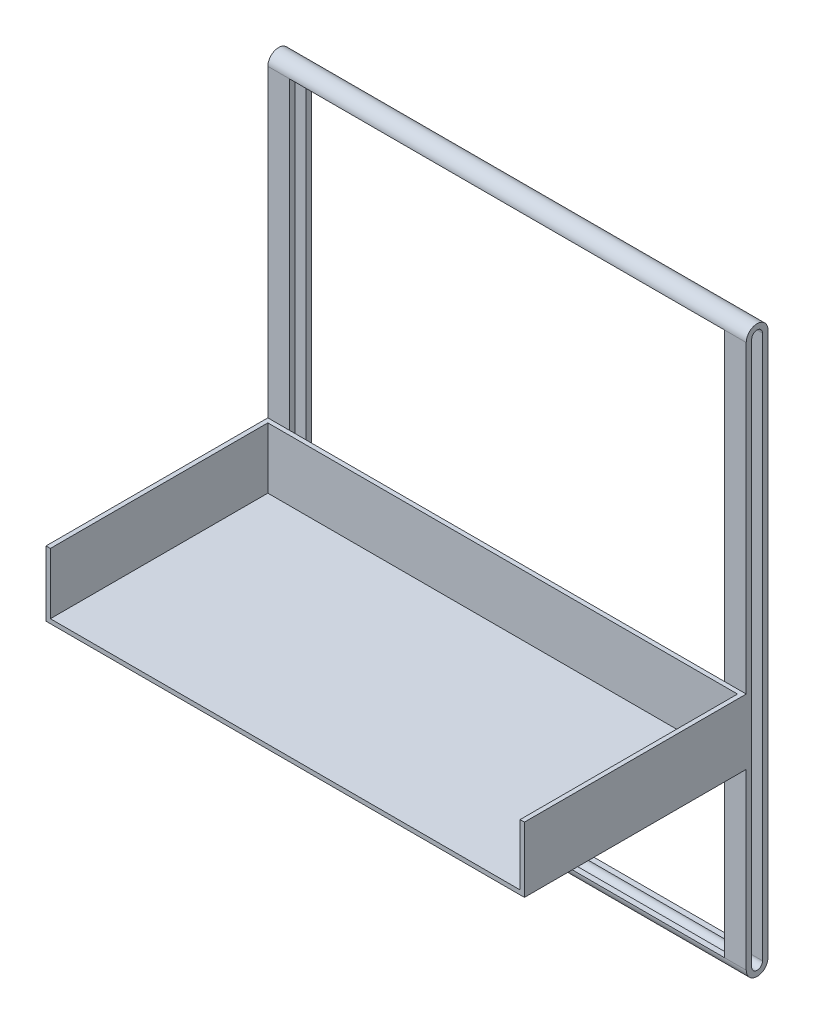
ISO-10303-21;
HEADER;
FILE_DESCRIPTION(('STEP AP214'),'2;1');
FILE_NAME('part.step','',(''),(''),'','','');
FILE_SCHEMA(('AUTOMOTIVE_DESIGN { 1 0 10303 214 1 1 1 1 }'));
ENDSEC;
DATA;
#1=APPLICATION_CONTEXT('core data for automotive mechanical design processes');
#2=APPLICATION_PROTOCOL_DEFINITION('international standard','automotive_design',2000,#1);
#3=PRODUCT_CONTEXT('',#1,'mechanical');
#4=PRODUCT('Part','Part','',(#3));
#5=PRODUCT_RELATED_PRODUCT_CATEGORY('part','',(#4));
#6=PRODUCT_DEFINITION_FORMATION('','',#4);
#7=PRODUCT_DEFINITION_CONTEXT('part definition',#1,'design');
#8=PRODUCT_DEFINITION('design','',#6,#7);
#9=PRODUCT_DEFINITION_SHAPE('','',#8);
#10=(LENGTH_UNIT() NAMED_UNIT(*) SI_UNIT(.MILLI.,.METRE.));
#11=(NAMED_UNIT(*) PLANE_ANGLE_UNIT() SI_UNIT($,.RADIAN.));
#12=(NAMED_UNIT(*) SI_UNIT($,.STERADIAN.) SOLID_ANGLE_UNIT());
#13=UNCERTAINTY_MEASURE_WITH_UNIT(LENGTH_MEASURE(1.E-05),#10,'distance_accuracy_value','');
#14=(GEOMETRIC_REPRESENTATION_CONTEXT(3) GLOBAL_UNCERTAINTY_ASSIGNED_CONTEXT((#13)) GLOBAL_UNIT_ASSIGNED_CONTEXT((#10,
#11,#12)) REPRESENTATION_CONTEXT('',''));
#15=CARTESIAN_POINT('',(0.,0.,0.));
#16=DIRECTION('',(0.,0.,1.));
#17=DIRECTION('',(1.,0.,0.));
#18=AXIS2_PLACEMENT_3D('',#15,#16,#17);
#19=CARTESIAN_POINT('',(0.,0.,2.));
#20=DIRECTION('',(0.,0.,1.));
#21=DIRECTION('',(1.,0.,0.));
#22=AXIS2_PLACEMENT_3D('',#19,#20,#21);
#23=PLANE('',#22);
#24=DIRECTION('',(-1.,0.,0.));
#25=VECTOR('',#24,1.);
#26=CARTESIAN_POINT('',(0.,-168.,2.));
#27=LINE('',#26,#25);
#28=CARTESIAN_POINT('',(218.,-168.,2.));
#29=VERTEX_POINT('',#28);
#30=CARTESIAN_POINT('',(2.,-168.,2.));
#31=VERTEX_POINT('',#30);
#32=EDGE_CURVE('E37',#29,#31,#27,.T.);
#33=ORIENTED_EDGE('',*,*,#32,.F.);
#34=DIRECTION('',(0.,-1.,0.));
#35=VECTOR('',#34,1.);
#36=CARTESIAN_POINT('',(218.,-168.,2.));
#37=LINE('',#36,#35);
#38=CARTESIAN_POINT('',(218.,-140.,2.));
#39=VERTEX_POINT('',#38);
#40=EDGE_CURVE('E237',#39,#29,#37,.T.);
#41=ORIENTED_EDGE('',*,*,#40,.F.);
#42=DIRECTION('',(-1.,0.,0.));
#43=VECTOR('',#42,1.);
#44=CARTESIAN_POINT('',(0.,-140.,2.));
#45=LINE('',#44,#43);
#46=CARTESIAN_POINT('',(2.,-140.,2.));
#47=VERTEX_POINT('',#46);
#48=EDGE_CURVE('E264',#39,#47,#45,.T.);
#49=ORIENTED_EDGE('',*,*,#48,.T.);
#50=DIRECTION('',(0.,1.,0.));
#51=VECTOR('',#50,1.);
#52=CARTESIAN_POINT('',(2.,-168.,2.));
#53=LINE('',#52,#51);
#54=EDGE_CURVE('E244',#31,#47,#53,.T.);
#55=ORIENTED_EDGE('',*,*,#54,.F.);
#56=EDGE_LOOP('',(#33,#41,#49,#55));
#57=FACE_BOUND('',#56,.T.);
#58=ADVANCED_FACE('F33',(#57),#23,.T.);
#59=CARTESIAN_POINT('',(0.,-168.,102.));
#60=DIRECTION('',(0.,-1.,0.));
#61=DIRECTION('',(0.,0.,-1.));
#62=AXIS2_PLACEMENT_3D('',#59,#60,#61);
#63=PLANE('',#62);
#64=DIRECTION('',(0.,0.,-1.));
#65=VECTOR('',#64,1.);
#66=CARTESIAN_POINT('',(218.,-168.,102.));
#67=LINE('',#66,#65);
#68=CARTESIAN_POINT('',(218.,-168.,102.));
#69=VERTEX_POINT('',#68);
#70=EDGE_CURVE('E50',#69,#29,#67,.T.);
#71=ORIENTED_EDGE('',*,*,#70,.T.);
#72=ORIENTED_EDGE('',*,*,#32,.T.);
#73=DIRECTION('',(0.,0.,-1.));
#74=VECTOR('',#73,1.);
#75=CARTESIAN_POINT('',(2.,-168.,102.));
#76=LINE('',#75,#74);
#77=CARTESIAN_POINT('',(2.,-168.,102.));
#78=VERTEX_POINT('',#77);
#79=EDGE_CURVE('E255',#78,#31,#76,.T.);
#80=ORIENTED_EDGE('',*,*,#79,.F.);
#81=DIRECTION('',(-1.,0.,0.));
#82=VECTOR('',#81,1.);
#83=CARTESIAN_POINT('',(0.,-168.,102.));
#84=LINE('',#83,#82);
#85=EDGE_CURVE('E231',#69,#78,#84,.T.);
#86=ORIENTED_EDGE('',*,*,#85,.F.);
#87=EDGE_LOOP('',(#71,#72,#80,#86));
#88=FACE_BOUND('',#87,.T.);
#89=ADVANCED_FACE('F518',(#88),#63,.F.);
#90=CARTESIAN_POINT('',(220.,0.,0.));
#91=DIRECTION('',(0.,0.,-1.));
#92=DIRECTION('',(0.,1.,0.));
#93=AXIS2_PLACEMENT_3D('',#90,#91,#92);
#94=PLANE('',#93);
#95=DIRECTION('',(1.,0.,0.));
#96=VECTOR('',#95,1.);
#97=CARTESIAN_POINT('',(0.,-170.,0.));
#98=LINE('',#97,#96);
#99=CARTESIAN_POINT('',(0.,-170.,0.));
#100=VERTEX_POINT('',#99);
#101=CARTESIAN_POINT('',(10.,-170.,0.));
#102=VERTEX_POINT('',#101);
#103=EDGE_CURVE('E58',#100,#102,#98,.T.);
#104=ORIENTED_EDGE('',*,*,#103,.F.);
#105=DIRECTION('',(0.,-1.,0.));
#106=VECTOR('',#105,1.);
#107=CARTESIAN_POINT('',(0.,0.,0.));
#108=LINE('',#107,#106);
#109=CARTESIAN_POINT('',(0.,-250.,0.));
#110=VERTEX_POINT('',#109);
#111=EDGE_CURVE('E387',#100,#110,#108,.T.);
#112=ORIENTED_EDGE('',*,*,#111,.T.);
#113=DIRECTION('',(-1.,0.,0.));
#114=VECTOR('',#113,1.);
#115=CARTESIAN_POINT('',(220.,-250.,0.));
#116=LINE('',#115,#114);
#117=CARTESIAN_POINT('',(10.,-250.,0.));
#118=VERTEX_POINT('',#117);
#119=EDGE_CURVE('E403',#118,#110,#116,.T.);
#120=ORIENTED_EDGE('',*,*,#119,.F.);
#121=DIRECTION('',(0.,-1.,0.));
#122=VECTOR('',#121,1.);
#123=CARTESIAN_POINT('',(10.,0.,0.));
#124=LINE('',#123,#122);
#125=EDGE_CURVE('E279',#102,#118,#124,.T.);
#126=ORIENTED_EDGE('',*,*,#125,.F.);
#127=EDGE_LOOP('',(#104,#112,#120,#126));
#128=FACE_BOUND('',#127,.T.);
#129=ADVANCED_FACE('F500',(#128),#94,.F.);
#130=DIRECTION('',(-1.,0.,0.));
#131=VECTOR('',#130,1.);
#132=CARTESIAN_POINT('',(0.,-140.,0.));
#133=LINE('',#132,#131);
#134=CARTESIAN_POINT('',(10.,-140.,0.));
#135=VERTEX_POINT('',#134);
#136=CARTESIAN_POINT('',(0.,-140.,0.));
#137=VERTEX_POINT('',#136);
#138=EDGE_CURVE('E268',#135,#137,#133,.T.);
#139=ORIENTED_EDGE('',*,*,#138,.F.);
#140=CARTESIAN_POINT('',(10.,0.,0.));
#141=VERTEX_POINT('',#140);
#142=EDGE_CURVE('E280',#141,#135,#124,.T.);
#143=ORIENTED_EDGE('',*,*,#142,.F.);
#144=DIRECTION('',(-1.,0.,0.));
#145=VECTOR('',#144,1.);
#146=CARTESIAN_POINT('',(220.,0.,0.));
#147=LINE('',#146,#145);
#148=CARTESIAN_POINT('',(0.,0.,0.));
#149=VERTEX_POINT('',#148);
#150=EDGE_CURVE('E407',#141,#149,#147,.T.);
#151=ORIENTED_EDGE('',*,*,#150,.T.);
#152=EDGE_CURVE('E388',#149,#137,#108,.T.);
#153=ORIENTED_EDGE('',*,*,#152,.T.);
#154=EDGE_LOOP('',(#139,#143,#151,#153));
#155=FACE_BOUND('',#154,.T.);
#156=ADVANCED_FACE('F462',(#155),#94,.F.);
#157=CARTESIAN_POINT('',(210.,-170.,0.));
#158=VERTEX_POINT('',#157);
#159=CARTESIAN_POINT('',(220.,-170.,0.));
#160=VERTEX_POINT('',#159);
#161=EDGE_CURVE('E261',#158,#160,#98,.T.);
#162=ORIENTED_EDGE('',*,*,#161,.F.);
#163=DIRECTION('',(0.,1.,0.));
#164=VECTOR('',#163,1.);
#165=CARTESIAN_POINT('',(210.,0.,0.));
#166=LINE('',#165,#164);
#167=CARTESIAN_POINT('',(210.,-250.,0.));
#168=VERTEX_POINT('',#167);
#169=EDGE_CURVE('E287',#168,#158,#166,.T.);
#170=ORIENTED_EDGE('',*,*,#169,.F.);
#171=CARTESIAN_POINT('',(220.,-250.,0.));
#172=VERTEX_POINT('',#171);
#173=EDGE_CURVE('E404',#172,#168,#116,.T.);
#174=ORIENTED_EDGE('',*,*,#173,.F.);
#175=DIRECTION('',(0.,-1.,0.));
#176=VECTOR('',#175,1.);
#177=CARTESIAN_POINT('',(220.,0.,0.));
#178=LINE('',#177,#176);
#179=EDGE_CURVE('E377',#160,#172,#178,.T.);
#180=ORIENTED_EDGE('',*,*,#179,.F.);
#181=EDGE_LOOP('',(#162,#170,#174,#180));
#182=FACE_BOUND('',#181,.T.);
#183=ADVANCED_FACE('F486',(#182),#94,.F.);
#184=CARTESIAN_POINT('',(220.,-140.,0.));
#185=VERTEX_POINT('',#184);
#186=CARTESIAN_POINT('',(210.,-140.,0.));
#187=VERTEX_POINT('',#186);
#188=EDGE_CURVE('E266',#185,#187,#133,.T.);
#189=ORIENTED_EDGE('',*,*,#188,.F.);
#190=CARTESIAN_POINT('',(220.,0.,0.));
#191=VERTEX_POINT('',#190);
#192=EDGE_CURVE('E216',#191,#185,#178,.T.);
#193=ORIENTED_EDGE('',*,*,#192,.F.);
#194=CARTESIAN_POINT('',(210.,0.,0.));
#195=VERTEX_POINT('',#194);
#196=EDGE_CURVE('E408',#191,#195,#147,.T.);
#197=ORIENTED_EDGE('',*,*,#196,.T.);
#198=EDGE_CURVE('E286',#187,#195,#166,.T.);
#199=ORIENTED_EDGE('',*,*,#198,.F.);
#200=EDGE_LOOP('',(#189,#193,#197,#199));
#201=FACE_BOUND('',#200,.T.);
#202=ADVANCED_FACE('F478',(#201),#94,.F.);
#203=CARTESIAN_POINT('',(220.,0.,-10.));
#204=DIRECTION('',(0.,0.,1.));
#205=DIRECTION('',(0.,-1.,0.));
#206=AXIS2_PLACEMENT_3D('',#203,#204,#205);
#207=PLANE('',#206);
#208=DIRECTION('',(-1.,0.,0.));
#209=VECTOR('',#208,1.);
#210=CARTESIAN_POINT('',(220.,0.,-10.));
#211=LINE('',#210,#209);
#212=CARTESIAN_POINT('',(10.,0.,-10.));
#213=VERTEX_POINT('',#212);
#214=CARTESIAN_POINT('',(0.,0.,-10.));
#215=VERTEX_POINT('',#214);
#216=EDGE_CURVE('E384',#213,#215,#211,.T.);
#217=ORIENTED_EDGE('',*,*,#216,.F.);
#218=DIRECTION('',(0.,-1.,0.));
#219=VECTOR('',#218,1.);
#220=CARTESIAN_POINT('',(10.,0.,-10.));
#221=LINE('',#220,#219);
#222=CARTESIAN_POINT('',(10.,-250.,-10.));
#223=VERTEX_POINT('',#222);
#224=EDGE_CURVE('E329',#213,#223,#221,.T.);
#225=ORIENTED_EDGE('',*,*,#224,.T.);
#226=DIRECTION('',(-1.,0.,0.));
#227=VECTOR('',#226,1.);
#228=CARTESIAN_POINT('',(220.,-250.,-10.));
#229=LINE('',#228,#227);
#230=CARTESIAN_POINT('',(0.,-250.,-10.));
#231=VERTEX_POINT('',#230);
#232=EDGE_CURVE('E399',#223,#231,#229,.T.);
#233=ORIENTED_EDGE('',*,*,#232,.T.);
#234=DIRECTION('',(0.,1.,0.));
#235=VECTOR('',#234,1.);
#236=CARTESIAN_POINT('',(0.,0.,-10.));
#237=LINE('',#236,#235);
#238=EDGE_CURVE('E378',#231,#215,#237,.T.);
#239=ORIENTED_EDGE('',*,*,#238,.T.);
#240=EDGE_LOOP('',(#217,#225,#233,#239));
#241=FACE_BOUND('',#240,.T.);
#242=ADVANCED_FACE('F516',(#241),#207,.F.);
#243=CARTESIAN_POINT('',(220.001,0.,-2.5));
#244=DIRECTION('',(0.,0.,1.));
#245=DIRECTION('',(0.,-1.,0.));
#246=AXIS2_PLACEMENT_3D('',#243,#244,#245);
#247=PLANE('',#246);
#248=DIRECTION('',(-1.,0.,0.));
#249=VECTOR('',#248,1.);
#250=CARTESIAN_POINT('',(220.001,0.,-2.5));
#251=LINE('',#250,#249);
#252=CARTESIAN_POINT('',(10.,0.,-2.5));
#253=VERTEX_POINT('',#252);
#254=CARTESIAN_POINT('',(0.,0.,-2.5));
#255=VERTEX_POINT('',#254);
#256=EDGE_CURVE('E358',#253,#255,#251,.T.);
#257=ORIENTED_EDGE('',*,*,#256,.F.);
#258=DIRECTION('',(0.,-1.,0.));
#259=VECTOR('',#258,1.);
#260=CARTESIAN_POINT('',(10.,0.,-2.5));
#261=LINE('',#260,#259);
#262=CARTESIAN_POINT('',(10.,-250.,-2.5));
#263=VERTEX_POINT('',#262);
#264=EDGE_CURVE('E326',#253,#263,#261,.T.);
#265=ORIENTED_EDGE('',*,*,#264,.T.);
#266=DIRECTION('',(-1.,0.,0.));
#267=VECTOR('',#266,1.);
#268=CARTESIAN_POINT('',(220.001,-250.,-2.5));
#269=LINE('',#268,#267);
#270=CARTESIAN_POINT('',(0.,-250.,-2.5));
#271=VERTEX_POINT('',#270);
#272=EDGE_CURVE('E362',#263,#271,#269,.T.);
#273=ORIENTED_EDGE('',*,*,#272,.T.);
#274=DIRECTION('',(0.,1.,0.));
#275=VECTOR('',#274,1.);
#276=CARTESIAN_POINT('',(0.,0.,-2.5));
#277=LINE('',#276,#275);
#278=EDGE_CURVE('E350',#271,#255,#277,.T.);
#279=ORIENTED_EDGE('',*,*,#278,.T.);
#280=EDGE_LOOP('',(#257,#265,#273,#279));
#281=FACE_BOUND('',#280,.T.);
#282=ADVANCED_FACE('F447',(#281),#247,.F.);
#283=CARTESIAN_POINT('',(220.001,0.,-7.5));
#284=DIRECTION('',(0.,0.,-1.));
#285=DIRECTION('',(0.,1.,0.));
#286=AXIS2_PLACEMENT_3D('',#283,#284,#285);
#287=PLANE('',#286);
#288=DIRECTION('',(-1.,0.,0.));
#289=VECTOR('',#288,1.);
#290=CARTESIAN_POINT('',(220.001,-250.,-7.49999999999997));
#291=LINE('',#290,#289);
#292=CARTESIAN_POINT('',(10.,-250.,-7.49999999999997));
#293=VERTEX_POINT('',#292);
#294=CARTESIAN_POINT('',(0.,-250.,-7.49999999999997));
#295=VERTEX_POINT('',#294);
#296=EDGE_CURVE('E367',#293,#295,#291,.T.);
#297=ORIENTED_EDGE('',*,*,#296,.F.);
#298=DIRECTION('',(0.,1.,0.));
#299=VECTOR('',#298,1.);
#300=CARTESIAN_POINT('',(10.,0.,-7.5));
#301=LINE('',#300,#299);
#302=CARTESIAN_POINT('',(10.,0.,-7.50000000000001));
#303=VERTEX_POINT('',#302);
#304=EDGE_CURVE('E11',#293,#303,#301,.T.);
#305=ORIENTED_EDGE('',*,*,#304,.T.);
#306=DIRECTION('',(-1.,0.,0.));
#307=VECTOR('',#306,1.);
#308=CARTESIAN_POINT('',(220.001,0.,-7.5));
#309=LINE('',#308,#307);
#310=CARTESIAN_POINT('',(0.,0.,-7.5));
#311=VERTEX_POINT('',#310);
#312=EDGE_CURVE('E353',#303,#311,#309,.T.);
#313=ORIENTED_EDGE('',*,*,#312,.T.);
#314=DIRECTION('',(0.,-1.,0.));
#315=VECTOR('',#314,1.);
#316=CARTESIAN_POINT('',(0.,0.,-7.5));
#317=LINE('',#316,#315);
#318=EDGE_CURVE('E344',#311,#295,#317,.T.);
#319=ORIENTED_EDGE('',*,*,#318,.T.);
#320=EDGE_LOOP('',(#297,#305,#313,#319));
#321=FACE_BOUND('',#320,.T.);
#322=ADVANCED_FACE('F435',(#321),#287,.F.);
#323=CARTESIAN_POINT('',(220.,0.,-5.));
#324=DIRECTION('',(-1.,0.,0.));
#325=DIRECTION('',(0.,0.,1.));
#326=AXIS2_PLACEMENT_3D('',#323,#324,#325);
#327=CYLINDRICAL_SURFACE('',#326,5.);
#328=CARTESIAN_POINT('',(0.,0.,-5.));
#329=DIRECTION('',(1.,0.,0.));
#330=DIRECTION('',(0.,0.,-1.));
#331=AXIS2_PLACEMENT_3D('',#328,#329,#330);
#332=CIRCLE('',#331,5.);
#333=EDGE_CURVE('E374',#215,#149,#332,.T.);
#334=ORIENTED_EDGE('',*,*,#333,.T.);
#335=ORIENTED_EDGE('',*,*,#150,.F.);
#336=DIRECTION('',(-1.,0.,0.));
#337=VECTOR('',#336,1.);
#338=CARTESIAN_POINT('',(10.,0.,0.));
#339=LINE('',#338,#337);
#340=EDGE_CURVE('E290',#195,#141,#339,.T.);
#341=ORIENTED_EDGE('',*,*,#340,.F.);
#342=ORIENTED_EDGE('',*,*,#196,.F.);
#343=CARTESIAN_POINT('',(220.,0.,-5.));
#344=DIRECTION('',(1.,0.,0.));
#345=DIRECTION('',(0.,0.,-1.));
#346=AXIS2_PLACEMENT_3D('',#343,#344,#345);
#347=CIRCLE('',#346,5.);
#348=CARTESIAN_POINT('',(220.,0.,-10.));
#349=VERTEX_POINT('',#348);
#350=EDGE_CURVE('E375',#349,#191,#347,.T.);
#351=ORIENTED_EDGE('',*,*,#350,.F.);
#352=CARTESIAN_POINT('',(210.,0.,-10.));
#353=VERTEX_POINT('',#352);
#354=EDGE_CURVE('E396',#349,#353,#211,.T.);
#355=ORIENTED_EDGE('',*,*,#354,.T.);
#356=DIRECTION('',(-1.,0.,0.));
#357=VECTOR('',#356,1.);
#358=CARTESIAN_POINT('',(220.,0.,-10.));
#359=LINE('',#358,#357);
#360=EDGE_CURVE('E323',#353,#213,#359,.T.);
#361=ORIENTED_EDGE('',*,*,#360,.T.);
#362=ORIENTED_EDGE('',*,*,#216,.T.);
#363=EDGE_LOOP('',(#334,#335,#341,#342,#351,#355,#361,#362));
#364=FACE_BOUND('',#363,.T.);
#365=ADVANCED_FACE('F35',(#364),#327,.T.);
#366=CARTESIAN_POINT('',(220.,-250.,-5.00000000000003));
#367=DIRECTION('',(-1.,0.,0.));
#368=DIRECTION('',(0.,0.,1.));
#369=AXIS2_PLACEMENT_3D('',#366,#367,#368);
#370=CYLINDRICAL_SURFACE('',#369,5.);
#371=CARTESIAN_POINT('',(0.,-250.,-5.00000000000003));
#372=DIRECTION('',(1.,0.,0.));
#373=DIRECTION('',(0.,0.,1.));
#374=AXIS2_PLACEMENT_3D('',#371,#372,#373);
#375=CIRCLE('',#374,5.);
#376=EDGE_CURVE('E391',#110,#231,#375,.T.);
#377=ORIENTED_EDGE('',*,*,#376,.T.);
#378=ORIENTED_EDGE('',*,*,#232,.F.);
#379=DIRECTION('',(1.,0.,0.));
#380=VECTOR('',#379,1.);
#381=CARTESIAN_POINT('',(220.,-250.,-10.));
#382=LINE('',#381,#380);
#383=CARTESIAN_POINT('',(210.,-250.,-10.));
#384=VERTEX_POINT('',#383);
#385=EDGE_CURVE('E311',#223,#384,#382,.T.);
#386=ORIENTED_EDGE('',*,*,#385,.T.);
#387=CARTESIAN_POINT('',(220.,-250.,-10.));
#388=VERTEX_POINT('',#387);
#389=EDGE_CURVE('E400',#388,#384,#229,.T.);
#390=ORIENTED_EDGE('',*,*,#389,.F.);
#391=CARTESIAN_POINT('',(220.,-250.,-5.00000000000003));
#392=DIRECTION('',(1.,0.,0.));
#393=DIRECTION('',(0.,0.,1.));
#394=AXIS2_PLACEMENT_3D('',#391,#392,#393);
#395=CIRCLE('',#394,5.);
#396=EDGE_CURVE('E380',#172,#388,#395,.T.);
#397=ORIENTED_EDGE('',*,*,#396,.F.);
#398=ORIENTED_EDGE('',*,*,#173,.T.);
#399=DIRECTION('',(1.,0.,0.));
#400=VECTOR('',#399,1.);
#401=CARTESIAN_POINT('',(10.,-250.,0.));
#402=LINE('',#401,#400);
#403=EDGE_CURVE('E283',#118,#168,#402,.T.);
#404=ORIENTED_EDGE('',*,*,#403,.F.);
#405=ORIENTED_EDGE('',*,*,#119,.T.);
#406=EDGE_LOOP('',(#377,#378,#386,#390,#397,#398,#404,#405));
#407=FACE_BOUND('',#406,.T.);
#408=ADVANCED_FACE('F491',(#407),#370,.T.);
#409=ORIENTED_EDGE('',*,*,#389,.T.);
#410=DIRECTION('',(0.,1.,0.));
#411=VECTOR('',#410,1.);
#412=CARTESIAN_POINT('',(210.,0.,-10.));
#413=LINE('',#412,#411);
#414=EDGE_CURVE('E317',#384,#353,#413,.T.);
#415=ORIENTED_EDGE('',*,*,#414,.T.);
#416=ORIENTED_EDGE('',*,*,#354,.F.);
#417=DIRECTION('',(0.,1.,0.));
#418=VECTOR('',#417,1.);
#419=CARTESIAN_POINT('',(220.,0.,-10.));
#420=LINE('',#419,#418);
#421=EDGE_CURVE('E382',#388,#349,#420,.T.);
#422=ORIENTED_EDGE('',*,*,#421,.F.);
#423=EDGE_LOOP('',(#409,#415,#416,#422));
#424=FACE_BOUND('',#423,.T.);
#425=ADVANCED_FACE('F557',(#424),#207,.F.);
#426=CARTESIAN_POINT('',(220.,0.,-5.));
#427=DIRECTION('',(1.,0.,0.));
#428=DIRECTION('',(0.,0.,-1.));
#429=AXIS2_PLACEMENT_3D('',#426,#427,#428);
#430=PLANE('',#429);
#431=CARTESIAN_POINT('',(220.,0.,-5.));
#432=DIRECTION('',(1.,0.,0.));
#433=DIRECTION('',(0.,0.,-1.));
#434=AXIS2_PLACEMENT_3D('',#431,#432,#433);
#435=CIRCLE('',#434,2.5);
#436=CARTESIAN_POINT('',(220.,0.,-2.5));
#437=VERTEX_POINT('',#436);
#438=CARTESIAN_POINT('',(220.,0.,-7.5));
#439=VERTEX_POINT('',#438);
#440=EDGE_CURVE('E338',#437,#439,#435,.F.);
#441=ORIENTED_EDGE('',*,*,#440,.T.);
#442=DIRECTION('',(0.,-1.,0.));
#443=VECTOR('',#442,1.);
#444=CARTESIAN_POINT('',(220.,0.,-7.5));
#445=LINE('',#444,#443);
#446=CARTESIAN_POINT('',(220.,-250.,-7.49999999999997));
#447=VERTEX_POINT('',#446);
#448=EDGE_CURVE('E357',#439,#447,#445,.T.);
#449=ORIENTED_EDGE('',*,*,#448,.T.);
#450=CARTESIAN_POINT('',(220.,-250.,-5.));
#451=DIRECTION('',(1.,0.,0.));
#452=DIRECTION('',(0.,0.,-1.));
#453=AXIS2_PLACEMENT_3D('',#450,#451,#452);
#454=CIRCLE('',#453,2.5);
#455=CARTESIAN_POINT('',(220.,-250.,-2.5));
#456=VERTEX_POINT('',#455);
#457=EDGE_CURVE('E332',#447,#456,#454,.F.);
#458=ORIENTED_EDGE('',*,*,#457,.T.);
#459=DIRECTION('',(0.,1.,0.));
#460=VECTOR('',#459,1.);
#461=CARTESIAN_POINT('',(220.,0.,-2.5));
#462=LINE('',#461,#460);
#463=EDGE_CURVE('E335',#456,#437,#462,.T.);
#464=ORIENTED_EDGE('',*,*,#463,.T.);
#465=EDGE_LOOP('',(#441,#449,#458,#464));
#466=FACE_BOUND('',#465,.T.);
#467=ORIENTED_EDGE('',*,*,#350,.T.);
#468=ORIENTED_EDGE('',*,*,#192,.T.);
#469=DIRECTION('',(0.,0.,-1.));
#470=VECTOR('',#469,1.);
#471=CARTESIAN_POINT('',(220.,-140.,2.));
#472=LINE('',#471,#470);
#473=CARTESIAN_POINT('',(220.,-140.,102.));
#474=VERTEX_POINT('',#473);
#475=EDGE_CURVE('E210',#474,#185,#472,.T.);
#476=ORIENTED_EDGE('',*,*,#475,.F.);
#477=DIRECTION('',(0.,1.,0.));
#478=VECTOR('',#477,1.);
#479=CARTESIAN_POINT('',(220.,-170.,102.));
#480=LINE('',#479,#478);
#481=CARTESIAN_POINT('',(220.,-170.,102.));
#482=VERTEX_POINT('',#481);
#483=EDGE_CURVE('E215',#482,#474,#480,.T.);
#484=ORIENTED_EDGE('',*,*,#483,.F.);
#485=DIRECTION('',(0.,0.,-1.));
#486=VECTOR('',#485,1.);
#487=CARTESIAN_POINT('',(220.,-170.,2.));
#488=LINE('',#487,#486);
#489=EDGE_CURVE('E220',#482,#160,#488,.T.);
#490=ORIENTED_EDGE('',*,*,#489,.T.);
#491=ORIENTED_EDGE('',*,*,#179,.T.);
#492=ORIENTED_EDGE('',*,*,#396,.T.);
#493=ORIENTED_EDGE('',*,*,#421,.T.);
#494=EDGE_LOOP('',(#467,#468,#476,#484,#490,#491,#492,#493));
#495=FACE_BOUND('',#494,.T.);
#496=ADVANCED_FACE('F213',(#466,#495),#430,.T.);
#497=CARTESIAN_POINT('',(0.,0.,-5.));
#498=DIRECTION('',(1.,0.,0.));
#499=DIRECTION('',(0.,0.,-1.));
#500=AXIS2_PLACEMENT_3D('',#497,#498,#499);
#501=PLANE('',#500);
#502=ORIENTED_EDGE('',*,*,#318,.F.);
#503=CARTESIAN_POINT('',(0.,0.,-5.));
#504=DIRECTION('',(-1.,0.,0.));
#505=DIRECTION('',(0.,0.,-1.));
#506=AXIS2_PLACEMENT_3D('',#503,#504,#505);
#507=CIRCLE('',#506,2.5);
#508=EDGE_CURVE('E341',#255,#311,#507,.T.);
#509=ORIENTED_EDGE('',*,*,#508,.F.);
#510=ORIENTED_EDGE('',*,*,#278,.F.);
#511=CARTESIAN_POINT('',(0.,-250.,-5.));
#512=DIRECTION('',(-1.,0.,0.));
#513=DIRECTION('',(0.,0.,1.));
#514=AXIS2_PLACEMENT_3D('',#511,#512,#513);
#515=CIRCLE('',#514,2.5);
#516=EDGE_CURVE('E347',#295,#271,#515,.T.);
#517=ORIENTED_EDGE('',*,*,#516,.F.);
#518=EDGE_LOOP('',(#502,#509,#510,#517));
#519=FACE_BOUND('',#518,.T.);
#520=ORIENTED_EDGE('',*,*,#333,.F.);
#521=ORIENTED_EDGE('',*,*,#238,.F.);
#522=ORIENTED_EDGE('',*,*,#376,.F.);
#523=ORIENTED_EDGE('',*,*,#111,.F.);
#524=DIRECTION('',(0.,0.,-1.));
#525=VECTOR('',#524,1.);
#526=CARTESIAN_POINT('',(0.,-170.,2.));
#527=LINE('',#526,#525);
#528=CARTESIAN_POINT('',(0.,-170.,102.));
#529=VERTEX_POINT('',#528);
#530=EDGE_CURVE('E275',#529,#100,#527,.T.);
#531=ORIENTED_EDGE('',*,*,#530,.F.);
#532=DIRECTION('',(0.,-1.,0.));
#533=VECTOR('',#532,1.);
#534=CARTESIAN_POINT('',(0.,-170.,102.));
#535=LINE('',#534,#533);
#536=CARTESIAN_POINT('',(0.,-140.,102.));
#537=VERTEX_POINT('',#536);
#538=EDGE_CURVE('E258',#537,#529,#535,.T.);
#539=ORIENTED_EDGE('',*,*,#538,.F.);
#540=DIRECTION('',(0.,0.,-1.));
#541=VECTOR('',#540,1.);
#542=CARTESIAN_POINT('',(0.,-140.,2.));
#543=LINE('',#542,#541);
#544=EDGE_CURVE('E221',#537,#137,#543,.T.);
#545=ORIENTED_EDGE('',*,*,#544,.T.);
#546=ORIENTED_EDGE('',*,*,#152,.F.);
#547=EDGE_LOOP('',(#520,#521,#522,#523,#531,#539,#545,#546));
#548=FACE_BOUND('',#547,.T.);
#549=ADVANCED_FACE('F443',(#519,#548),#501,.F.);
#550=CARTESIAN_POINT('',(220.001,0.,-5.));
#551=DIRECTION('',(-1.,0.,0.));
#552=DIRECTION('',(0.,0.,1.));
#553=AXIS2_PLACEMENT_3D('',#550,#551,#552);
#554=CYLINDRICAL_SURFACE('',#553,2.5);
#555=CARTESIAN_POINT('',(210.,0.,-2.49999999999997));
#556=VERTEX_POINT('',#555);
#557=EDGE_CURVE('E354',#437,#556,#251,.T.);
#558=ORIENTED_EDGE('',*,*,#557,.T.);
#559=DIRECTION('',(-1.,0.,0.));
#560=VECTOR('',#559,1.);
#561=CARTESIAN_POINT('',(220.001,0.,-2.5));
#562=LINE('',#561,#560);
#563=EDGE_CURVE('E320',#556,#253,#562,.T.);
#564=ORIENTED_EDGE('',*,*,#563,.T.);
#565=ORIENTED_EDGE('',*,*,#256,.T.);
#566=ORIENTED_EDGE('',*,*,#508,.T.);
#567=ORIENTED_EDGE('',*,*,#312,.F.);
#568=CARTESIAN_POINT('',(210.,0.,-7.49999999999998));
#569=VERTEX_POINT('',#568);
#570=EDGE_CURVE('E371',#569,#303,#309,.T.);
#571=ORIENTED_EDGE('',*,*,#570,.F.);
#572=EDGE_CURVE('E368',#439,#569,#309,.T.);
#573=ORIENTED_EDGE('',*,*,#572,.F.);
#574=ORIENTED_EDGE('',*,*,#440,.F.);
#575=EDGE_LOOP('',(#558,#564,#565,#566,#567,#571,#573,#574));
#576=FACE_BOUND('',#575,.T.);
#577=ADVANCED_FACE('F427',(#576),#554,.F.);
#578=CARTESIAN_POINT('',(210.,-250.,-2.5));
#579=VERTEX_POINT('',#578);
#580=EDGE_CURVE('E359',#456,#579,#269,.T.);
#581=ORIENTED_EDGE('',*,*,#580,.T.);
#582=DIRECTION('',(0.,1.,0.));
#583=VECTOR('',#582,1.);
#584=CARTESIAN_POINT('',(210.,0.,-2.5));
#585=LINE('',#584,#583);
#586=EDGE_CURVE('E314',#579,#556,#585,.T.);
#587=ORIENTED_EDGE('',*,*,#586,.T.);
#588=ORIENTED_EDGE('',*,*,#557,.F.);
#589=ORIENTED_EDGE('',*,*,#463,.F.);
#590=EDGE_LOOP('',(#581,#587,#588,#589));
#591=FACE_BOUND('',#590,.T.);
#592=ADVANCED_FACE('F505',(#591),#247,.F.);
#593=CARTESIAN_POINT('',(220.001,-250.,-5.));
#594=DIRECTION('',(-1.,0.,0.));
#595=DIRECTION('',(0.,0.,1.));
#596=AXIS2_PLACEMENT_3D('',#593,#594,#595);
#597=CYLINDRICAL_SURFACE('',#596,2.5);
#598=CARTESIAN_POINT('',(210.,-250.,-7.49999999999998));
#599=VERTEX_POINT('',#598);
#600=EDGE_CURVE('E363',#447,#599,#291,.T.);
#601=ORIENTED_EDGE('',*,*,#600,.T.);
#602=EDGE_CURVE('E366',#599,#293,#291,.T.);
#603=ORIENTED_EDGE('',*,*,#602,.T.);
#604=ORIENTED_EDGE('',*,*,#296,.T.);
#605=ORIENTED_EDGE('',*,*,#516,.T.);
#606=ORIENTED_EDGE('',*,*,#272,.F.);
#607=DIRECTION('',(-1.,0.,0.));
#608=VECTOR('',#607,1.);
#609=CARTESIAN_POINT('',(220.001,-250.,-2.5));
#610=LINE('',#609,#608);
#611=EDGE_CURVE('E308',#263,#579,#610,.F.);
#612=ORIENTED_EDGE('',*,*,#611,.T.);
#613=ORIENTED_EDGE('',*,*,#580,.F.);
#614=ORIENTED_EDGE('',*,*,#457,.F.);
#615=EDGE_LOOP('',(#601,#603,#604,#605,#606,#612,#613,#614));
#616=FACE_BOUND('',#615,.T.);
#617=ADVANCED_FACE('F422',(#616),#597,.F.);
#618=ORIENTED_EDGE('',*,*,#572,.T.);
#619=DIRECTION('',(0.,-1.,0.));
#620=VECTOR('',#619,1.);
#621=CARTESIAN_POINT('',(210.,0.,-7.5));
#622=LINE('',#621,#620);
#623=EDGE_CURVE('E43',#569,#599,#622,.T.);
#624=ORIENTED_EDGE('',*,*,#623,.T.);
#625=ORIENTED_EDGE('',*,*,#600,.F.);
#626=ORIENTED_EDGE('',*,*,#448,.F.);
#627=EDGE_LOOP('',(#618,#624,#625,#626));
#628=FACE_BOUND('',#627,.T.);
#629=ADVANCED_FACE('F413',(#628),#287,.F.);
#630=CARTESIAN_POINT('',(10.,-250.,-200.));
#631=DIRECTION('',(0.,-1.,0.));
#632=DIRECTION('',(0.,0.,-1.));
#633=AXIS2_PLACEMENT_3D('',#630,#631,#632);
#634=PLANE('',#633);
#635=DIRECTION('',(0.,0.,1.));
#636=VECTOR('',#635,1.);
#637=CARTESIAN_POINT('',(10.,-250.,-200.));
#638=LINE('',#637,#636);
#639=EDGE_CURVE('E305',#223,#293,#638,.T.);
#640=ORIENTED_EDGE('',*,*,#639,.T.);
#641=ORIENTED_EDGE('',*,*,#602,.F.);
#642=DIRECTION('',(0.,0.,1.));
#643=VECTOR('',#642,1.);
#644=CARTESIAN_POINT('',(210.,-250.,-200.));
#645=LINE('',#644,#643);
#646=EDGE_CURVE('E302',#384,#599,#645,.T.);
#647=ORIENTED_EDGE('',*,*,#646,.F.);
#648=ORIENTED_EDGE('',*,*,#385,.F.);
#649=EDGE_LOOP('',(#640,#641,#647,#648));
#650=FACE_BOUND('',#649,.T.);
#651=ADVANCED_FACE('F543',(#650),#634,.F.);
#652=CARTESIAN_POINT('',(210.,0.,-200.));
#653=DIRECTION('',(1.,0.,0.));
#654=DIRECTION('',(0.,1.,0.));
#655=AXIS2_PLACEMENT_3D('',#652,#653,#654);
#656=PLANE('',#655);
#657=ORIENTED_EDGE('',*,*,#646,.T.);
#658=ORIENTED_EDGE('',*,*,#623,.F.);
#659=DIRECTION('',(0.,0.,1.));
#660=VECTOR('',#659,1.);
#661=CARTESIAN_POINT('',(210.,0.,-200.));
#662=LINE('',#661,#660);
#663=EDGE_CURVE('E298',#353,#569,#662,.T.);
#664=ORIENTED_EDGE('',*,*,#663,.F.);
#665=ORIENTED_EDGE('',*,*,#414,.F.);
#666=EDGE_LOOP('',(#657,#658,#664,#665));
#667=FACE_BOUND('',#666,.T.);
#668=ADVANCED_FACE('F540',(#667),#656,.F.);
#669=CARTESIAN_POINT('',(10.,0.,-200.));
#670=DIRECTION('',(0.,1.,0.));
#671=DIRECTION('',(0.,0.,1.));
#672=AXIS2_PLACEMENT_3D('',#669,#670,#671);
#673=PLANE('',#672);
#674=ORIENTED_EDGE('',*,*,#663,.T.);
#675=ORIENTED_EDGE('',*,*,#570,.T.);
#676=DIRECTION('',(0.,0.,1.));
#677=VECTOR('',#676,1.);
#678=CARTESIAN_POINT('',(10.,0.,-200.));
#679=LINE('',#678,#677);
#680=EDGE_CURVE('E297',#213,#303,#679,.T.);
#681=ORIENTED_EDGE('',*,*,#680,.F.);
#682=ORIENTED_EDGE('',*,*,#360,.F.);
#683=EDGE_LOOP('',(#674,#675,#681,#682));
#684=FACE_BOUND('',#683,.T.);
#685=ADVANCED_FACE('F536',(#684),#673,.F.);
#686=CARTESIAN_POINT('',(10.,0.,-200.));
#687=DIRECTION('',(-1.,0.,0.));
#688=DIRECTION('',(0.,-1.,0.));
#689=AXIS2_PLACEMENT_3D('',#686,#687,#688);
#690=PLANE('',#689);
#691=ORIENTED_EDGE('',*,*,#680,.T.);
#692=ORIENTED_EDGE('',*,*,#304,.F.);
#693=ORIENTED_EDGE('',*,*,#639,.F.);
#694=ORIENTED_EDGE('',*,*,#224,.F.);
#695=EDGE_LOOP('',(#691,#692,#693,#694));
#696=FACE_BOUND('',#695,.T.);
#697=ADVANCED_FACE('F539',(#696),#690,.F.);
#698=EDGE_CURVE('E295',#253,#141,#679,.T.);
#699=ORIENTED_EDGE('',*,*,#698,.T.);
#700=ORIENTED_EDGE('',*,*,#142,.T.);
#701=DIRECTION('',(0.,1.,0.));
#702=VECTOR('',#701,1.);
#703=CARTESIAN_POINT('',(10.,0.,0.));
#704=LINE('',#703,#702);
#705=EDGE_CURVE('E277',#102,#135,#704,.T.);
#706=ORIENTED_EDGE('',*,*,#705,.F.);
#707=ORIENTED_EDGE('',*,*,#125,.T.);
#708=EDGE_CURVE('E294',#263,#118,#638,.T.);
#709=ORIENTED_EDGE('',*,*,#708,.F.);
#710=ORIENTED_EDGE('',*,*,#264,.F.);
#711=EDGE_LOOP('',(#699,#700,#706,#707,#709,#710));
#712=FACE_BOUND('',#711,.T.);
#713=ADVANCED_FACE('F451',(#712),#690,.F.);
#714=EDGE_CURVE('E299',#556,#195,#662,.T.);
#715=ORIENTED_EDGE('',*,*,#714,.T.);
#716=ORIENTED_EDGE('',*,*,#340,.T.);
#717=ORIENTED_EDGE('',*,*,#698,.F.);
#718=ORIENTED_EDGE('',*,*,#563,.F.);
#719=EDGE_LOOP('',(#715,#716,#717,#718));
#720=FACE_BOUND('',#719,.T.);
#721=ADVANCED_FACE('F453',(#720),#673,.F.);
#722=EDGE_CURVE('E303',#579,#168,#645,.T.);
#723=ORIENTED_EDGE('',*,*,#722,.T.);
#724=ORIENTED_EDGE('',*,*,#169,.T.);
#725=EDGE_CURVE('E291',#158,#187,#166,.T.);
#726=ORIENTED_EDGE('',*,*,#725,.T.);
#727=ORIENTED_EDGE('',*,*,#198,.T.);
#728=ORIENTED_EDGE('',*,*,#714,.F.);
#729=ORIENTED_EDGE('',*,*,#586,.F.);
#730=EDGE_LOOP('',(#723,#724,#726,#727,#728,#729));
#731=FACE_BOUND('',#730,.T.);
#732=ADVANCED_FACE('F480',(#731),#656,.F.);
#733=ORIENTED_EDGE('',*,*,#708,.T.);
#734=ORIENTED_EDGE('',*,*,#403,.T.);
#735=ORIENTED_EDGE('',*,*,#722,.F.);
#736=ORIENTED_EDGE('',*,*,#611,.F.);
#737=EDGE_LOOP('',(#733,#734,#735,#736));
#738=FACE_BOUND('',#737,.T.);
#739=ADVANCED_FACE('F503',(#738),#634,.F.);
#740=CARTESIAN_POINT('',(0.,0.,0.));
#741=DIRECTION('',(0.,0.,1.));
#742=DIRECTION('',(1.,0.,0.));
#743=AXIS2_PLACEMENT_3D('',#740,#741,#742);
#744=PLANE('',#743);
#745=EDGE_CURVE('E269',#102,#158,#98,.T.);
#746=ORIENTED_EDGE('',*,*,#745,.F.);
#747=ORIENTED_EDGE('',*,*,#705,.T.);
#748=EDGE_CURVE('E271',#187,#135,#133,.T.);
#749=ORIENTED_EDGE('',*,*,#748,.F.);
#750=ORIENTED_EDGE('',*,*,#725,.F.);
#751=EDGE_LOOP('',(#746,#747,#749,#750));
#752=FACE_BOUND('',#751,.T.);
#753=ADVANCED_FACE('F475',(#752),#744,.F.);
#754=CARTESIAN_POINT('',(0.,-170.,2.));
#755=DIRECTION('',(0.,1.,0.));
#756=DIRECTION('',(0.,0.,1.));
#757=AXIS2_PLACEMENT_3D('',#754,#755,#756);
#758=PLANE('',#757);
#759=ORIENTED_EDGE('',*,*,#103,.T.);
#760=ORIENTED_EDGE('',*,*,#745,.T.);
#761=ORIENTED_EDGE('',*,*,#161,.T.);
#762=ORIENTED_EDGE('',*,*,#489,.F.);
#763=DIRECTION('',(1.,0.,0.));
#764=VECTOR('',#763,1.);
#765=CARTESIAN_POINT('',(0.,-170.,102.));
#766=LINE('',#765,#764);
#767=EDGE_CURVE('E230',#529,#482,#766,.T.);
#768=ORIENTED_EDGE('',*,*,#767,.F.);
#769=ORIENTED_EDGE('',*,*,#530,.T.);
#770=EDGE_LOOP('',(#759,#760,#761,#762,#768,#769));
#771=FACE_BOUND('',#770,.T.);
#772=ADVANCED_FACE('F496',(#771),#758,.F.);
#773=CARTESIAN_POINT('',(0.,-140.,2.));
#774=DIRECTION('',(0.,-1.,0.));
#775=DIRECTION('',(0.,0.,-1.));
#776=AXIS2_PLACEMENT_3D('',#773,#774,#775);
#777=PLANE('',#776);
#778=ORIENTED_EDGE('',*,*,#188,.T.);
#779=ORIENTED_EDGE('',*,*,#748,.T.);
#780=ORIENTED_EDGE('',*,*,#138,.T.);
#781=ORIENTED_EDGE('',*,*,#544,.F.);
#782=DIRECTION('',(-1.,0.,0.));
#783=VECTOR('',#782,1.);
#784=CARTESIAN_POINT('',(0.,-140.,102.));
#785=LINE('',#784,#783);
#786=CARTESIAN_POINT('',(2.,-140.,102.));
#787=VERTEX_POINT('',#786);
#788=EDGE_CURVE('E247',#787,#537,#785,.T.);
#789=ORIENTED_EDGE('',*,*,#788,.F.);
#790=DIRECTION('',(0.,0.,-1.));
#791=VECTOR('',#790,1.);
#792=CARTESIAN_POINT('',(2.,-140.,102.));
#793=LINE('',#792,#791);
#794=EDGE_CURVE('E250',#787,#47,#793,.T.);
#795=ORIENTED_EDGE('',*,*,#794,.T.);
#796=ORIENTED_EDGE('',*,*,#48,.F.);
#797=DIRECTION('',(0.,0.,-1.));
#798=VECTOR('',#797,1.);
#799=CARTESIAN_POINT('',(218.,-140.,102.));
#800=LINE('',#799,#798);
#801=CARTESIAN_POINT('',(218.,-140.,102.));
#802=VERTEX_POINT('',#801);
#803=EDGE_CURVE('E235',#802,#39,#800,.T.);
#804=ORIENTED_EDGE('',*,*,#803,.F.);
#805=DIRECTION('',(-1.,0.,0.));
#806=VECTOR('',#805,1.);
#807=CARTESIAN_POINT('',(220.,-140.,102.));
#808=LINE('',#807,#806);
#809=EDGE_CURVE('E227',#474,#802,#808,.T.);
#810=ORIENTED_EDGE('',*,*,#809,.F.);
#811=ORIENTED_EDGE('',*,*,#475,.T.);
#812=EDGE_LOOP('',(#778,#779,#780,#781,#789,#795,#796,#804,#810,#811));
#813=FACE_BOUND('',#812,.T.);
#814=ADVANCED_FACE('F233',(#813),#777,.F.);
#815=CARTESIAN_POINT('',(0.,0.,102.));
#816=DIRECTION('',(0.,0.,-1.));
#817=DIRECTION('',(-1.,0.,0.));
#818=AXIS2_PLACEMENT_3D('',#815,#816,#817);
#819=PLANE('',#818);
#820=ORIENTED_EDGE('',*,*,#538,.T.);
#821=ORIENTED_EDGE('',*,*,#767,.T.);
#822=ORIENTED_EDGE('',*,*,#483,.T.);
#823=ORIENTED_EDGE('',*,*,#809,.T.);
#824=DIRECTION('',(0.,-1.,0.));
#825=VECTOR('',#824,1.);
#826=CARTESIAN_POINT('',(218.,-168.,102.));
#827=LINE('',#826,#825);
#828=EDGE_CURVE('E236',#802,#69,#827,.T.);
#829=ORIENTED_EDGE('',*,*,#828,.T.);
#830=ORIENTED_EDGE('',*,*,#85,.T.);
#831=DIRECTION('',(0.,1.,0.));
#832=VECTOR('',#831,1.);
#833=CARTESIAN_POINT('',(2.,-168.,102.));
#834=LINE('',#833,#832);
#835=EDGE_CURVE('E245',#78,#787,#834,.T.);
#836=ORIENTED_EDGE('',*,*,#835,.T.);
#837=ORIENTED_EDGE('',*,*,#788,.T.);
#838=EDGE_LOOP('',(#820,#821,#822,#823,#829,#830,#836,#837));
#839=FACE_BOUND('',#838,.T.);
#840=ADVANCED_FACE('F226',(#839),#819,.F.);
#841=CARTESIAN_POINT('',(2.,-168.,102.));
#842=DIRECTION('',(-1.,0.,0.));
#843=DIRECTION('',(0.,-1.,0.));
#844=AXIS2_PLACEMENT_3D('',#841,#842,#843);
#845=PLANE('',#844);
#846=ORIENTED_EDGE('',*,*,#54,.T.);
#847=ORIENTED_EDGE('',*,*,#794,.F.);
#848=ORIENTED_EDGE('',*,*,#835,.F.);
#849=ORIENTED_EDGE('',*,*,#79,.T.);
#850=EDGE_LOOP('',(#846,#847,#848,#849));
#851=FACE_BOUND('',#850,.T.);
#852=ADVANCED_FACE('F742',(#851),#845,.F.);
#853=CARTESIAN_POINT('',(218.,-168.,102.));
#854=DIRECTION('',(1.,0.,0.));
#855=DIRECTION('',(0.,0.,-1.));
#856=AXIS2_PLACEMENT_3D('',#853,#854,#855);
#857=PLANE('',#856);
#858=ORIENTED_EDGE('',*,*,#40,.T.);
#859=ORIENTED_EDGE('',*,*,#70,.F.);
#860=ORIENTED_EDGE('',*,*,#828,.F.);
#861=ORIENTED_EDGE('',*,*,#803,.T.);
#862=EDGE_LOOP('',(#858,#859,#860,#861));
#863=FACE_BOUND('',#862,.T.);
#864=ADVANCED_FACE('F774',(#863),#857,.F.);
#865=CLOSED_SHELL('',(#58,#89,#129,#156,#183,#202,#242,#282,#322,#365,#408,#425,#496,#549,#577,
#592,#617,#629,#651,#668,#685,#697,#713,#721,#732,#739,#753,#772,#814,#840,#852,#864));
#866=MANIFOLD_SOLID_BREP('B2',#865);
#867=ADVANCED_BREP_SHAPE_REPRESENTATION('',(#18,#866),#14);
#868=SHAPE_DEFINITION_REPRESENTATION(#9,#867);
ENDSEC;
END-ISO-10303-21;
